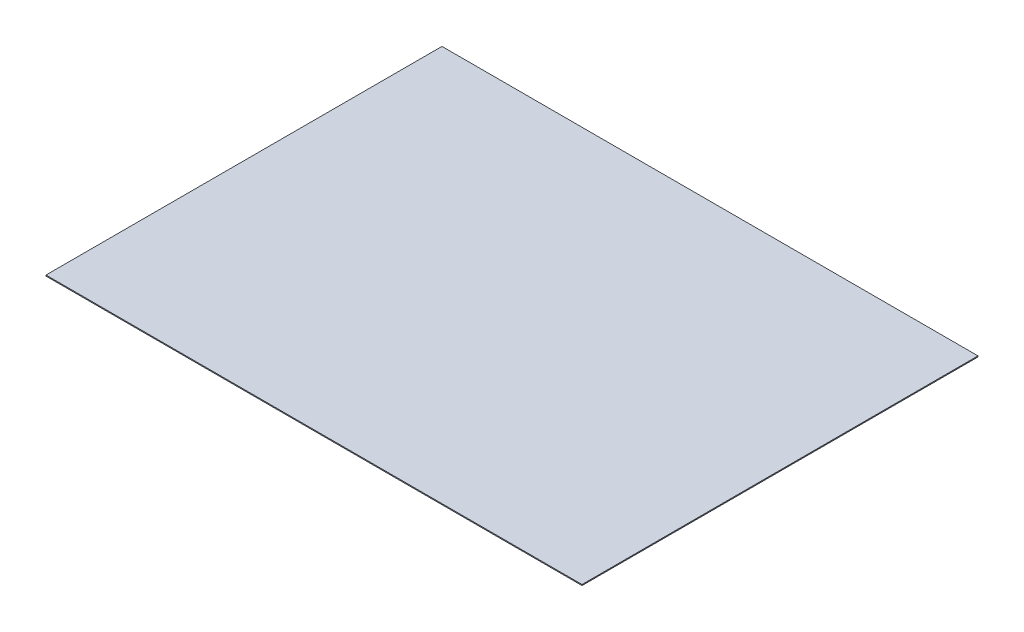
ISO-10303-21;
HEADER;
FILE_DESCRIPTION(('STEP AP214'),'2;1');
FILE_NAME('part.step','',(''),(''),'','','');
FILE_SCHEMA(('AUTOMOTIVE_DESIGN { 1 0 10303 214 1 1 1 1 }'));
ENDSEC;
DATA;
#1=APPLICATION_CONTEXT('core data for automotive mechanical design processes');
#2=APPLICATION_PROTOCOL_DEFINITION('international standard','automotive_design',2000,#1);
#3=PRODUCT_CONTEXT('',#1,'mechanical');
#4=PRODUCT('Part','Part','',(#3));
#5=PRODUCT_RELATED_PRODUCT_CATEGORY('part','',(#4));
#6=PRODUCT_DEFINITION_FORMATION('','',#4);
#7=PRODUCT_DEFINITION_CONTEXT('part definition',#1,'design');
#8=PRODUCT_DEFINITION('design','',#6,#7);
#9=PRODUCT_DEFINITION_SHAPE('','',#8);
#10=(LENGTH_UNIT() NAMED_UNIT(*) SI_UNIT(.MILLI.,.METRE.));
#11=(NAMED_UNIT(*) PLANE_ANGLE_UNIT() SI_UNIT($,.RADIAN.));
#12=(NAMED_UNIT(*) SI_UNIT($,.STERADIAN.) SOLID_ANGLE_UNIT());
#13=UNCERTAINTY_MEASURE_WITH_UNIT(LENGTH_MEASURE(1.E-05),#10,'distance_accuracy_value','');
#14=(GEOMETRIC_REPRESENTATION_CONTEXT(3) GLOBAL_UNCERTAINTY_ASSIGNED_CONTEXT((#13)) GLOBAL_UNIT_ASSIGNED_CONTEXT((#10,
#11,#12)) REPRESENTATION_CONTEXT('',''));
#15=CARTESIAN_POINT('',(0.,0.,0.));
#16=DIRECTION('',(0.,0.,1.));
#17=DIRECTION('',(1.,0.,0.));
#18=AXIS2_PLACEMENT_3D('',#15,#16,#17);
#19=CARTESIAN_POINT('',(0.,2.921,0.));
#20=DIRECTION('',(1.,0.,0.));
#21=DIRECTION('',(0.,0.,-1.));
#22=AXIS2_PLACEMENT_3D('',#19,#20,#21);
#23=PLANE('',#22);
#24=DIRECTION('',(0.,0.,1.));
#25=VECTOR('',#24,1.);
#26=CARTESIAN_POINT('',(0.,0.,0.));
#27=LINE('',#26,#25);
#28=CARTESIAN_POINT('',(0.,0.,-1193.8));
#29=VERTEX_POINT('',#28);
#30=CARTESIAN_POINT('',(0.,0.,0.));
#31=VERTEX_POINT('',#30);
#32=EDGE_CURVE('E98',#29,#31,#27,.T.);
#33=ORIENTED_EDGE('',*,*,#32,.T.);
#34=DIRECTION('',(0.,-1.,0.));
#35=VECTOR('',#34,1.);
#36=CARTESIAN_POINT('',(0.,2.921,0.));
#37=LINE('',#36,#35);
#38=CARTESIAN_POINT('',(0.,2.921,0.));
#39=VERTEX_POINT('',#38);
#40=EDGE_CURVE('E11',#39,#31,#37,.T.);
#41=ORIENTED_EDGE('',*,*,#40,.F.);
#42=DIRECTION('',(0.,0.,1.));
#43=VECTOR('',#42,1.);
#44=CARTESIAN_POINT('',(0.,2.921,0.));
#45=LINE('',#44,#43);
#46=CARTESIAN_POINT('',(0.,2.921,-1193.8));
#47=VERTEX_POINT('',#46);
#48=EDGE_CURVE('E86',#47,#39,#45,.T.);
#49=ORIENTED_EDGE('',*,*,#48,.F.);
#50=DIRECTION('',(0.,-1.,0.));
#51=VECTOR('',#50,1.);
#52=CARTESIAN_POINT('',(0.,2.921,-1193.8));
#53=LINE('',#52,#51);
#54=EDGE_CURVE('E94',#47,#29,#53,.T.);
#55=ORIENTED_EDGE('',*,*,#54,.T.);
#56=EDGE_LOOP('',(#33,#41,#49,#55));
#57=FACE_BOUND('',#56,.T.);
#58=ADVANCED_FACE('F35',(#57),#23,.F.);
#59=CARTESIAN_POINT('',(0.,2.921,0.));
#60=DIRECTION('',(0.,0.,-1.));
#61=DIRECTION('',(-1.,0.,0.));
#62=AXIS2_PLACEMENT_3D('',#59,#60,#61);
#63=PLANE('',#62);
#64=DIRECTION('',(1.,0.,0.));
#65=VECTOR('',#64,1.);
#66=CARTESIAN_POINT('',(0.,0.,0.));
#67=LINE('',#66,#65);
#68=CARTESIAN_POINT('',(1616.075,0.,0.));
#69=VERTEX_POINT('',#68);
#70=EDGE_CURVE('E90',#31,#69,#67,.T.);
#71=ORIENTED_EDGE('',*,*,#70,.T.);
#72=DIRECTION('',(0.,-1.,0.));
#73=VECTOR('',#72,1.);
#74=CARTESIAN_POINT('',(1616.075,2.921,0.));
#75=LINE('',#74,#73);
#76=CARTESIAN_POINT('',(1616.075,2.921,0.));
#77=VERTEX_POINT('',#76);
#78=EDGE_CURVE('E43',#77,#69,#75,.T.);
#79=ORIENTED_EDGE('',*,*,#78,.F.);
#80=DIRECTION('',(1.,0.,0.));
#81=VECTOR('',#80,1.);
#82=CARTESIAN_POINT('',(0.,2.921,0.));
#83=LINE('',#82,#81);
#84=EDGE_CURVE('E81',#39,#77,#83,.T.);
#85=ORIENTED_EDGE('',*,*,#84,.F.);
#86=ORIENTED_EDGE('',*,*,#40,.T.);
#87=EDGE_LOOP('',(#71,#79,#85,#86));
#88=FACE_BOUND('',#87,.T.);
#89=ADVANCED_FACE('F89',(#88),#63,.F.);
#90=CARTESIAN_POINT('',(1616.075,2.921,0.));
#91=DIRECTION('',(-1.,0.,0.));
#92=DIRECTION('',(0.,0.,1.));
#93=AXIS2_PLACEMENT_3D('',#90,#91,#92);
#94=PLANE('',#93);
#95=DIRECTION('',(0.,0.,-1.));
#96=VECTOR('',#95,1.);
#97=CARTESIAN_POINT('',(1616.075,0.,0.));
#98=LINE('',#97,#96);
#99=CARTESIAN_POINT('',(1616.075,0.,-1193.8));
#100=VERTEX_POINT('',#99);
#101=EDGE_CURVE('E68',#69,#100,#98,.T.);
#102=ORIENTED_EDGE('',*,*,#101,.T.);
#103=DIRECTION('',(0.,-1.,0.));
#104=VECTOR('',#103,1.);
#105=CARTESIAN_POINT('',(1616.075,2.921,-1193.8));
#106=LINE('',#105,#104);
#107=CARTESIAN_POINT('',(1616.075,2.921,-1193.8));
#108=VERTEX_POINT('',#107);
#109=EDGE_CURVE('E91',#108,#100,#106,.T.);
#110=ORIENTED_EDGE('',*,*,#109,.F.);
#111=DIRECTION('',(0.,0.,-1.));
#112=VECTOR('',#111,1.);
#113=CARTESIAN_POINT('',(1616.075,2.921,0.));
#114=LINE('',#113,#112);
#115=EDGE_CURVE('E84',#77,#108,#114,.T.);
#116=ORIENTED_EDGE('',*,*,#115,.F.);
#117=ORIENTED_EDGE('',*,*,#78,.T.);
#118=EDGE_LOOP('',(#102,#110,#116,#117));
#119=FACE_BOUND('',#118,.T.);
#120=ADVANCED_FACE('F92',(#119),#94,.F.);
#121=CARTESIAN_POINT('',(0.,2.921,-1193.8));
#122=DIRECTION('',(0.,0.,1.));
#123=DIRECTION('',(1.,0.,0.));
#124=AXIS2_PLACEMENT_3D('',#121,#122,#123);
#125=PLANE('',#124);
#126=DIRECTION('',(-1.,0.,0.));
#127=VECTOR('',#126,1.);
#128=CARTESIAN_POINT('',(0.,0.,-1193.8));
#129=LINE('',#128,#127);
#130=EDGE_CURVE('E74',#100,#29,#129,.T.);
#131=ORIENTED_EDGE('',*,*,#130,.T.);
#132=ORIENTED_EDGE('',*,*,#54,.F.);
#133=DIRECTION('',(-1.,0.,0.));
#134=VECTOR('',#133,1.);
#135=CARTESIAN_POINT('',(0.,2.921,-1193.8));
#136=LINE('',#135,#134);
#137=EDGE_CURVE('E51',#108,#47,#136,.T.);
#138=ORIENTED_EDGE('',*,*,#137,.F.);
#139=ORIENTED_EDGE('',*,*,#109,.T.);
#140=EDGE_LOOP('',(#131,#132,#138,#139));
#141=FACE_BOUND('',#140,.T.);
#142=ADVANCED_FACE('F105',(#141),#125,.F.);
#143=CARTESIAN_POINT('',(0.,2.921,0.));
#144=DIRECTION('',(0.,-1.,0.));
#145=DIRECTION('',(0.,0.,-1.));
#146=AXIS2_PLACEMENT_3D('',#143,#144,#145);
#147=PLANE('',#146);
#148=ORIENTED_EDGE('',*,*,#48,.T.);
#149=ORIENTED_EDGE('',*,*,#84,.T.);
#150=ORIENTED_EDGE('',*,*,#115,.T.);
#151=ORIENTED_EDGE('',*,*,#137,.T.);
#152=EDGE_LOOP('',(#148,#149,#150,#151));
#153=FACE_BOUND('',#152,.T.);
#154=ADVANCED_FACE('F82',(#153),#147,.F.);
#155=CARTESIAN_POINT('',(0.,0.,0.));
#156=DIRECTION('',(0.,-1.,0.));
#157=DIRECTION('',(0.,0.,-1.));
#158=AXIS2_PLACEMENT_3D('',#155,#156,#157);
#159=PLANE('',#158);
#160=ORIENTED_EDGE('',*,*,#32,.F.);
#161=ORIENTED_EDGE('',*,*,#130,.F.);
#162=ORIENTED_EDGE('',*,*,#101,.F.);
#163=ORIENTED_EDGE('',*,*,#70,.F.);
#164=EDGE_LOOP('',(#160,#161,#162,#163));
#165=FACE_BOUND('',#164,.T.);
#166=ADVANCED_FACE('F108',(#165),#159,.T.);
#167=CLOSED_SHELL('',(#58,#89,#120,#142,#154,#166));
#168=MANIFOLD_SOLID_BREP('B2',#167);
#169=ADVANCED_BREP_SHAPE_REPRESENTATION('',(#18,#168),#14);
#170=SHAPE_DEFINITION_REPRESENTATION(#9,#169);
ENDSEC;
END-ISO-10303-21;
